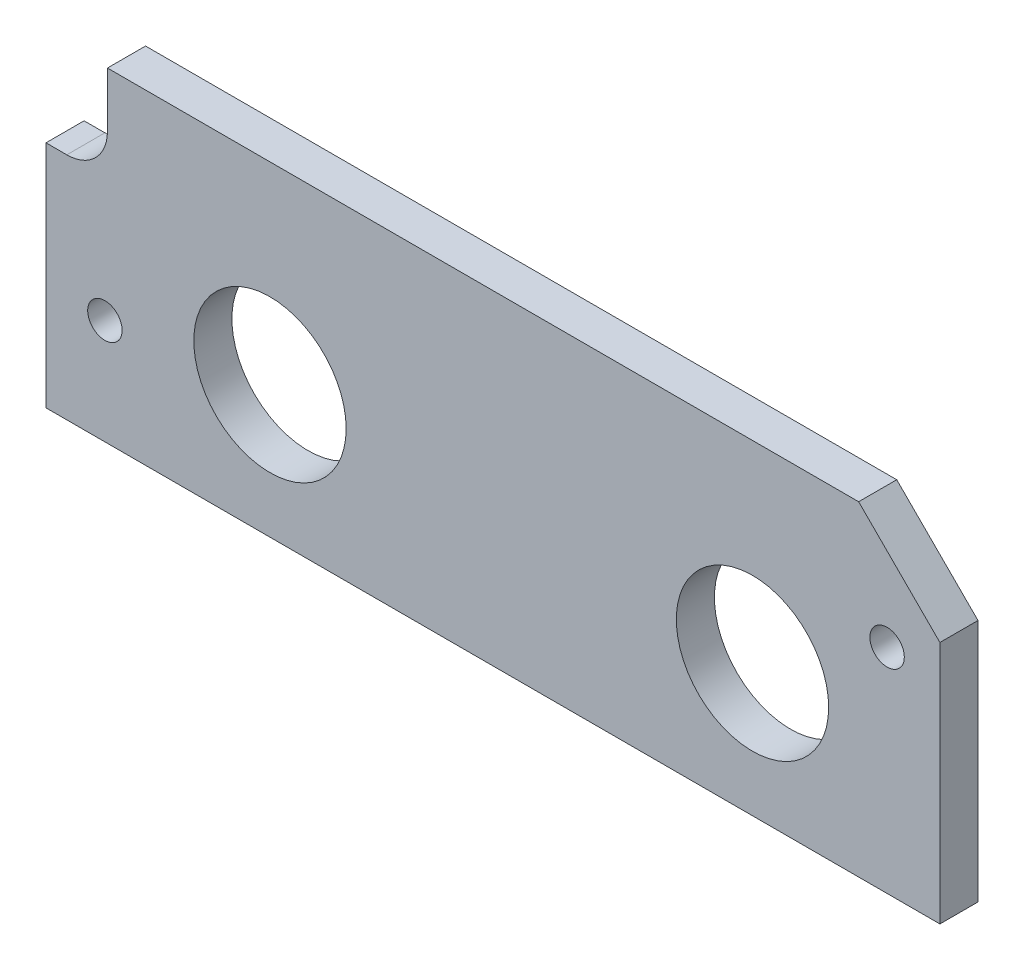
ISO-10303-21;
HEADER;
FILE_DESCRIPTION(('STEP AP214'),'2;1');
FILE_NAME('part.step','',(''),(''),'','','');
FILE_SCHEMA(('AUTOMOTIVE_DESIGN { 1 0 10303 214 1 1 1 1 }'));
ENDSEC;
DATA;
#1=APPLICATION_CONTEXT('core data for automotive mechanical design processes');
#2=APPLICATION_PROTOCOL_DEFINITION('international standard','automotive_design',2000,#1);
#3=PRODUCT_CONTEXT('',#1,'mechanical');
#4=PRODUCT('Part','Part','',(#3));
#5=PRODUCT_RELATED_PRODUCT_CATEGORY('part','',(#4));
#6=PRODUCT_DEFINITION_FORMATION('','',#4);
#7=PRODUCT_DEFINITION_CONTEXT('part definition',#1,'design');
#8=PRODUCT_DEFINITION('design','',#6,#7);
#9=PRODUCT_DEFINITION_SHAPE('','',#8);
#10=(LENGTH_UNIT() NAMED_UNIT(*) SI_UNIT(.MILLI.,.METRE.));
#11=(NAMED_UNIT(*) PLANE_ANGLE_UNIT() SI_UNIT($,.RADIAN.));
#12=(NAMED_UNIT(*) SI_UNIT($,.STERADIAN.) SOLID_ANGLE_UNIT());
#13=UNCERTAINTY_MEASURE_WITH_UNIT(LENGTH_MEASURE(1.E-05),#10,'distance_accuracy_value','');
#14=(GEOMETRIC_REPRESENTATION_CONTEXT(3) GLOBAL_UNCERTAINTY_ASSIGNED_CONTEXT((#13)) GLOBAL_UNIT_ASSIGNED_CONTEXT((#10,
#11,#12)) REPRESENTATION_CONTEXT('',''));
#15=CARTESIAN_POINT('',(0.,0.,0.));
#16=DIRECTION('',(0.,0.,1.));
#17=DIRECTION('',(1.,0.,0.));
#18=AXIS2_PLACEMENT_3D('',#15,#16,#17);
#19=CARTESIAN_POINT('',(-39.116,57.658,4.7625));
#20=DIRECTION('',(0.,-1.,0.));
#21=DIRECTION('',(0.,0.,-1.));
#22=AXIS2_PLACEMENT_3D('',#19,#20,#21);
#23=PLANE('',#22);
#24=DIRECTION('',(-1.,0.,0.));
#25=VECTOR('',#24,1.);
#26=CARTESIAN_POINT('',(-39.116,57.658,0.));
#27=LINE('',#26,#25);
#28=CARTESIAN_POINT('',(-39.116,57.658,0.));
#29=VERTEX_POINT('',#28);
#30=CARTESIAN_POINT('',(-133.0325,57.658,0.));
#31=VERTEX_POINT('',#30);
#32=EDGE_CURVE('E128',#29,#31,#27,.T.);
#33=ORIENTED_EDGE('',*,*,#32,.T.);
#34=DIRECTION('',(0.,0.,-1.));
#35=VECTOR('',#34,1.);
#36=CARTESIAN_POINT('',(-133.0325,57.658,4.7625));
#37=LINE('',#36,#35);
#38=CARTESIAN_POINT('',(-133.0325,57.658,4.7625));
#39=VERTEX_POINT('',#38);
#40=EDGE_CURVE('E11',#39,#31,#37,.T.);
#41=ORIENTED_EDGE('',*,*,#40,.F.);
#42=DIRECTION('',(-1.,0.,0.));
#43=VECTOR('',#42,1.);
#44=CARTESIAN_POINT('',(-39.116,57.658,4.7625));
#45=LINE('',#44,#43);
#46=CARTESIAN_POINT('',(-39.116,57.658,4.7625));
#47=VERTEX_POINT('',#46);
#48=EDGE_CURVE('E143',#47,#39,#45,.T.);
#49=ORIENTED_EDGE('',*,*,#48,.F.);
#50=DIRECTION('',(0.,0.,-1.));
#51=VECTOR('',#50,1.);
#52=CARTESIAN_POINT('',(-39.116,57.658,4.7625));
#53=LINE('',#52,#51);
#54=EDGE_CURVE('E124',#47,#29,#53,.T.);
#55=ORIENTED_EDGE('',*,*,#54,.T.);
#56=EDGE_LOOP('',(#33,#41,#49,#55));
#57=FACE_BOUND('',#56,.T.);
#58=ADVANCED_FACE('F32',(#57),#23,.F.);
#59=CARTESIAN_POINT('',(-133.0325,57.658,4.7625));
#60=DIRECTION('',(1.,0.,0.));
#61=DIRECTION('',(0.,0.,-1.));
#62=AXIS2_PLACEMENT_3D('',#59,#60,#61);
#63=PLANE('',#62);
#64=DIRECTION('',(0.,-1.,0.));
#65=VECTOR('',#64,1.);
#66=CARTESIAN_POINT('',(-133.0325,57.658,0.));
#67=LINE('',#66,#65);
#68=CARTESIAN_POINT('',(-133.0325,50.8,0.));
#69=VERTEX_POINT('',#68);
#70=EDGE_CURVE('E131',#31,#69,#67,.T.);
#71=ORIENTED_EDGE('',*,*,#70,.T.);
#72=DIRECTION('',(0.,0.,-1.));
#73=VECTOR('',#72,1.);
#74=CARTESIAN_POINT('',(-133.0325,50.8,4.7625));
#75=LINE('',#74,#73);
#76=CARTESIAN_POINT('',(-133.0325,50.8,4.7625));
#77=VERTEX_POINT('',#76);
#78=EDGE_CURVE('E40',#77,#69,#75,.T.);
#79=ORIENTED_EDGE('',*,*,#78,.F.);
#80=DIRECTION('',(0.,-1.,0.));
#81=VECTOR('',#80,1.);
#82=CARTESIAN_POINT('',(-133.0325,57.658,4.7625));
#83=LINE('',#82,#81);
#84=EDGE_CURVE('E91',#39,#77,#83,.T.);
#85=ORIENTED_EDGE('',*,*,#84,.F.);
#86=ORIENTED_EDGE('',*,*,#40,.T.);
#87=EDGE_LOOP('',(#71,#79,#85,#86));
#88=FACE_BOUND('',#87,.T.);
#89=ADVANCED_FACE('F228',(#88),#63,.F.);
#90=CARTESIAN_POINT('',(-138.1125,50.8,4.7625));
#91=DIRECTION('',(0.,0.,-1.));
#92=DIRECTION('',(-1.,0.,0.));
#93=AXIS2_PLACEMENT_3D('',#90,#91,#92);
#94=CYLINDRICAL_SURFACE('',#93,5.08);
#95=CARTESIAN_POINT('',(-138.1125,50.8,0.));
#96=DIRECTION('',(0.,0.,-1.));
#97=DIRECTION('',(1.,0.,0.));
#98=AXIS2_PLACEMENT_3D('',#95,#96,#97);
#99=CIRCLE('',#98,5.08);
#100=CARTESIAN_POINT('',(-138.1125,45.72,0.));
#101=VERTEX_POINT('',#100);
#102=EDGE_CURVE('E134',#69,#101,#99,.T.);
#103=ORIENTED_EDGE('',*,*,#102,.T.);
#104=DIRECTION('',(0.,0.,-1.));
#105=VECTOR('',#104,1.);
#106=CARTESIAN_POINT('',(-138.1125,45.72,4.7625));
#107=LINE('',#106,#105);
#108=CARTESIAN_POINT('',(-138.1125,45.72,4.7625));
#109=VERTEX_POINT('',#108);
#110=EDGE_CURVE('E150',#109,#101,#107,.T.);
#111=ORIENTED_EDGE('',*,*,#110,.F.);
#112=CARTESIAN_POINT('',(-138.1125,50.8,4.7625));
#113=DIRECTION('',(0.,0.,-1.));
#114=DIRECTION('',(1.,0.,0.));
#115=AXIS2_PLACEMENT_3D('',#112,#113,#114);
#116=CIRCLE('',#115,5.08);
#117=EDGE_CURVE('E158',#77,#109,#116,.T.);
#118=ORIENTED_EDGE('',*,*,#117,.F.);
#119=ORIENTED_EDGE('',*,*,#78,.T.);
#120=EDGE_LOOP('',(#103,#111,#118,#119));
#121=FACE_BOUND('',#120,.T.);
#122=ADVANCED_FACE('F156',(#121),#94,.F.);
#123=CARTESIAN_POINT('',(-138.1125,45.72,4.7625));
#124=DIRECTION('',(0.,-1.,0.));
#125=DIRECTION('',(1.,0.,0.));
#126=AXIS2_PLACEMENT_3D('',#123,#124,#125);
#127=PLANE('',#126);
#128=DIRECTION('',(-1.,0.,0.));
#129=VECTOR('',#128,1.);
#130=CARTESIAN_POINT('',(-138.1125,45.72,0.));
#131=LINE('',#130,#129);
#132=CARTESIAN_POINT('',(-140.716,45.72,0.));
#133=VERTEX_POINT('',#132);
#134=EDGE_CURVE('E136',#101,#133,#131,.T.);
#135=ORIENTED_EDGE('',*,*,#134,.T.);
#136=DIRECTION('',(0.,0.,-1.));
#137=VECTOR('',#136,1.);
#138=CARTESIAN_POINT('',(-140.716,45.72,4.7625));
#139=LINE('',#138,#137);
#140=CARTESIAN_POINT('',(-140.716,45.72,4.7625));
#141=VERTEX_POINT('',#140);
#142=EDGE_CURVE('E147',#141,#133,#139,.T.);
#143=ORIENTED_EDGE('',*,*,#142,.F.);
#144=DIRECTION('',(-1.,0.,0.));
#145=VECTOR('',#144,1.);
#146=CARTESIAN_POINT('',(-138.1125,45.72,4.7625));
#147=LINE('',#146,#145);
#148=EDGE_CURVE('E170',#109,#141,#147,.T.);
#149=ORIENTED_EDGE('',*,*,#148,.F.);
#150=ORIENTED_EDGE('',*,*,#110,.T.);
#151=EDGE_LOOP('',(#135,#143,#149,#150));
#152=FACE_BOUND('',#151,.T.);
#153=ADVANCED_FACE('F166',(#152),#127,.F.);
#154=CARTESIAN_POINT('',(-140.716,45.72,4.7625));
#155=DIRECTION('',(1.,0.,0.));
#156=DIRECTION('',(0.,0.,-1.));
#157=AXIS2_PLACEMENT_3D('',#154,#155,#156);
#158=PLANE('',#157);
#159=DIRECTION('',(0.,-1.,0.));
#160=VECTOR('',#159,1.);
#161=CARTESIAN_POINT('',(-140.716,45.72,0.));
#162=LINE('',#161,#160);
#163=CARTESIAN_POINT('',(-140.716,17.0180000000001,0.));
#164=VERTEX_POINT('',#163);
#165=EDGE_CURVE('E138',#133,#164,#162,.T.);
#166=ORIENTED_EDGE('',*,*,#165,.T.);
#167=DIRECTION('',(0.,0.,-1.));
#168=VECTOR('',#167,1.);
#169=CARTESIAN_POINT('',(-140.716,17.0180000000001,4.7625));
#170=LINE('',#169,#168);
#171=CARTESIAN_POINT('',(-140.716,17.0180000000001,4.7625));
#172=VERTEX_POINT('',#171);
#173=EDGE_CURVE('E119',#172,#164,#170,.T.);
#174=ORIENTED_EDGE('',*,*,#173,.F.);
#175=DIRECTION('',(0.,-1.,0.));
#176=VECTOR('',#175,1.);
#177=CARTESIAN_POINT('',(-140.716,45.72,4.7625));
#178=LINE('',#177,#176);
#179=EDGE_CURVE('E110',#141,#172,#178,.T.);
#180=ORIENTED_EDGE('',*,*,#179,.F.);
#181=ORIENTED_EDGE('',*,*,#142,.T.);
#182=EDGE_LOOP('',(#166,#174,#180,#181));
#183=FACE_BOUND('',#182,.T.);
#184=ADVANCED_FACE('F169',(#183),#158,.F.);
#185=CARTESIAN_POINT('',(-140.716,17.0180000000001,4.7625));
#186=DIRECTION('',(0.,1.,0.));
#187=DIRECTION('',(-1.,0.,0.));
#188=AXIS2_PLACEMENT_3D('',#185,#186,#187);
#189=PLANE('',#188);
#190=DIRECTION('',(1.,0.,0.));
#191=VECTOR('',#190,1.);
#192=CARTESIAN_POINT('',(-140.716,17.0180000000001,0.));
#193=LINE('',#192,#191);
#194=CARTESIAN_POINT('',(-28.956,17.018,0.));
#195=VERTEX_POINT('',#194);
#196=EDGE_CURVE('E118',#164,#195,#193,.T.);
#197=ORIENTED_EDGE('',*,*,#196,.T.);
#198=DIRECTION('',(0.,0.,-1.));
#199=VECTOR('',#198,1.);
#200=CARTESIAN_POINT('',(-28.956,17.018,4.7625));
#201=LINE('',#200,#199);
#202=CARTESIAN_POINT('',(-28.956,17.018,4.7625));
#203=VERTEX_POINT('',#202);
#204=EDGE_CURVE('E115',#203,#195,#201,.T.);
#205=ORIENTED_EDGE('',*,*,#204,.F.);
#206=DIRECTION('',(1.,0.,0.));
#207=VECTOR('',#206,1.);
#208=CARTESIAN_POINT('',(-140.716,17.0180000000001,4.7625));
#209=LINE('',#208,#207);
#210=EDGE_CURVE('E104',#172,#203,#209,.T.);
#211=ORIENTED_EDGE('',*,*,#210,.F.);
#212=ORIENTED_EDGE('',*,*,#173,.T.);
#213=EDGE_LOOP('',(#197,#205,#211,#212));
#214=FACE_BOUND('',#213,.T.);
#215=ADVANCED_FACE('F116',(#214),#189,.F.);
#216=CARTESIAN_POINT('',(-28.956,17.018,4.7625));
#217=DIRECTION('',(-1.,0.,0.));
#218=DIRECTION('',(0.,0.,1.));
#219=AXIS2_PLACEMENT_3D('',#216,#217,#218);
#220=PLANE('',#219);
#221=DIRECTION('',(0.,1.,0.));
#222=VECTOR('',#221,1.);
#223=CARTESIAN_POINT('',(-28.956,17.018,0.));
#224=LINE('',#223,#222);
#225=CARTESIAN_POINT('',(-28.956,47.498,0.));
#226=VERTEX_POINT('',#225);
#227=EDGE_CURVE('E77',#195,#226,#224,.T.);
#228=ORIENTED_EDGE('',*,*,#227,.T.);
#229=DIRECTION('',(0.,0.,-1.));
#230=VECTOR('',#229,1.);
#231=CARTESIAN_POINT('',(-28.956,47.498,4.7625));
#232=LINE('',#231,#230);
#233=CARTESIAN_POINT('',(-28.956,47.498,4.7625));
#234=VERTEX_POINT('',#233);
#235=EDGE_CURVE('E120',#234,#226,#232,.T.);
#236=ORIENTED_EDGE('',*,*,#235,.F.);
#237=DIRECTION('',(0.,1.,0.));
#238=VECTOR('',#237,1.);
#239=CARTESIAN_POINT('',(-28.956,17.018,4.7625));
#240=LINE('',#239,#238);
#241=EDGE_CURVE('E108',#203,#234,#240,.T.);
#242=ORIENTED_EDGE('',*,*,#241,.F.);
#243=ORIENTED_EDGE('',*,*,#204,.T.);
#244=EDGE_LOOP('',(#228,#236,#242,#243));
#245=FACE_BOUND('',#244,.T.);
#246=ADVANCED_FACE('F122',(#245),#220,.F.);
#247=CARTESIAN_POINT('',(-28.956,47.498,4.7625));
#248=DIRECTION('',(-0.707106781186548,-0.707106781186548,0.));
#249=DIRECTION('',(0.707106781186548,-0.707106781186548,0.));
#250=AXIS2_PLACEMENT_3D('',#247,#248,#249);
#251=PLANE('',#250);
#252=DIRECTION('',(-0.707106781186548,0.707106781186548,0.));
#253=VECTOR('',#252,1.);
#254=CARTESIAN_POINT('',(-28.956,47.498,0.));
#255=LINE('',#254,#253);
#256=EDGE_CURVE('E83',#226,#29,#255,.T.);
#257=ORIENTED_EDGE('',*,*,#256,.T.);
#258=ORIENTED_EDGE('',*,*,#54,.F.);
#259=DIRECTION('',(-0.707106781186548,0.707106781186548,0.));
#260=VECTOR('',#259,1.);
#261=CARTESIAN_POINT('',(-28.956,47.498,4.7625));
#262=LINE('',#261,#260);
#263=EDGE_CURVE('E48',#234,#47,#262,.T.);
#264=ORIENTED_EDGE('',*,*,#263,.F.);
#265=ORIENTED_EDGE('',*,*,#235,.T.);
#266=EDGE_LOOP('',(#257,#258,#264,#265));
#267=FACE_BOUND('',#266,.T.);
#268=ADVANCED_FACE('F204',(#267),#251,.F.);
#269=CARTESIAN_POINT('',(-138.1125,50.8,4.7625));
#270=DIRECTION('',(0.,0.,1.));
#271=DIRECTION('',(1.,0.,0.));
#272=AXIS2_PLACEMENT_3D('',#269,#270,#271);
#273=PLANE('',#272);
#274=CARTESIAN_POINT('',(-112.7125,33.528,4.7625));
#275=DIRECTION('',(0.,0.,1.));
#276=DIRECTION('',(1.,0.,0.));
#277=AXIS2_PLACEMENT_3D('',#274,#275,#276);
#278=CIRCLE('',#277,9.52499999999999);
#279=CARTESIAN_POINT('',(-103.1875,33.528,4.7625));
#280=VERTEX_POINT('',#279);
#281=EDGE_CURVE('E196',#280,#280,#278,.T.);
#282=ORIENTED_EDGE('',*,*,#281,.F.);
#283=EDGE_LOOP('',(#282));
#284=FACE_BOUND('',#283,.T.);
#285=CARTESIAN_POINT('',(-52.3875,33.528,4.7625));
#286=DIRECTION('',(0.,0.,1.));
#287=DIRECTION('',(1.,0.,0.));
#288=AXIS2_PLACEMENT_3D('',#285,#286,#287);
#289=CIRCLE('',#288,9.525);
#290=CARTESIAN_POINT('',(-42.8625,33.528,4.7625));
#291=VERTEX_POINT('',#290);
#292=EDGE_CURVE('E190',#291,#291,#289,.T.);
#293=ORIENTED_EDGE('',*,*,#292,.F.);
#294=EDGE_LOOP('',(#293));
#295=FACE_BOUND('',#294,.T.);
#296=CARTESIAN_POINT('',(-133.35,30.1625,4.7625));
#297=DIRECTION('',(0.,0.,1.));
#298=DIRECTION('',(1.,0.,0.));
#299=AXIS2_PLACEMENT_3D('',#296,#297,#298);
#300=CIRCLE('',#299,2.15264999999998);
#301=CARTESIAN_POINT('',(-131.19735,30.1625,4.7625));
#302=VERTEX_POINT('',#301);
#303=EDGE_CURVE('E184',#302,#302,#300,.T.);
#304=ORIENTED_EDGE('',*,*,#303,.F.);
#305=EDGE_LOOP('',(#304));
#306=FACE_BOUND('',#305,.T.);
#307=CARTESIAN_POINT('',(-35.56,43.688,4.7625));
#308=DIRECTION('',(0.,0.,1.));
#309=DIRECTION('',(1.,0.,0.));
#310=AXIS2_PLACEMENT_3D('',#307,#308,#309);
#311=CIRCLE('',#310,2.15264999999999);
#312=CARTESIAN_POINT('',(-33.40735,43.688,4.7625));
#313=VERTEX_POINT('',#312);
#314=EDGE_CURVE('E178',#313,#313,#311,.T.);
#315=ORIENTED_EDGE('',*,*,#314,.F.);
#316=EDGE_LOOP('',(#315));
#317=FACE_BOUND('',#316,.T.);
#318=ORIENTED_EDGE('',*,*,#48,.T.);
#319=ORIENTED_EDGE('',*,*,#84,.T.);
#320=ORIENTED_EDGE('',*,*,#117,.T.);
#321=ORIENTED_EDGE('',*,*,#148,.T.);
#322=ORIENTED_EDGE('',*,*,#179,.T.);
#323=ORIENTED_EDGE('',*,*,#210,.T.);
#324=ORIENTED_EDGE('',*,*,#241,.T.);
#325=ORIENTED_EDGE('',*,*,#263,.T.);
#326=EDGE_LOOP('',(#318,#319,#320,#321,#322,#323,#324,#325));
#327=FACE_BOUND('',#326,.T.);
#328=ADVANCED_FACE('F106',(#284,#295,#306,#317,#327),#273,.T.);
#329=CARTESIAN_POINT('',(-138.1125,50.8,0.));
#330=DIRECTION('',(0.,0.,1.));
#331=DIRECTION('',(1.,0.,0.));
#332=AXIS2_PLACEMENT_3D('',#329,#330,#331);
#333=PLANE('',#332);
#334=CARTESIAN_POINT('',(-112.7125,33.528,0.));
#335=DIRECTION('',(0.,0.,1.));
#336=DIRECTION('',(1.,0.,0.));
#337=AXIS2_PLACEMENT_3D('',#334,#335,#336);
#338=CIRCLE('',#337,9.52499999999999);
#339=CARTESIAN_POINT('',(-103.1875,33.528,0.));
#340=VERTEX_POINT('',#339);
#341=EDGE_CURVE('E193',#340,#340,#338,.T.);
#342=ORIENTED_EDGE('',*,*,#341,.T.);
#343=EDGE_LOOP('',(#342));
#344=FACE_BOUND('',#343,.T.);
#345=CARTESIAN_POINT('',(-52.3875,33.528,0.));
#346=DIRECTION('',(0.,0.,1.));
#347=DIRECTION('',(1.,0.,0.));
#348=AXIS2_PLACEMENT_3D('',#345,#346,#347);
#349=CIRCLE('',#348,9.525);
#350=CARTESIAN_POINT('',(-42.8625,33.528,0.));
#351=VERTEX_POINT('',#350);
#352=EDGE_CURVE('E187',#351,#351,#349,.T.);
#353=ORIENTED_EDGE('',*,*,#352,.T.);
#354=EDGE_LOOP('',(#353));
#355=FACE_BOUND('',#354,.T.);
#356=CARTESIAN_POINT('',(-133.35,30.1625,0.));
#357=DIRECTION('',(0.,0.,1.));
#358=DIRECTION('',(1.,0.,0.));
#359=AXIS2_PLACEMENT_3D('',#356,#357,#358);
#360=CIRCLE('',#359,2.15265000000001);
#361=CARTESIAN_POINT('',(-131.19735,30.1625,0.));
#362=VERTEX_POINT('',#361);
#363=EDGE_CURVE('E181',#362,#362,#360,.T.);
#364=ORIENTED_EDGE('',*,*,#363,.T.);
#365=EDGE_LOOP('',(#364));
#366=FACE_BOUND('',#365,.T.);
#367=CARTESIAN_POINT('',(-35.56,43.688,0.));
#368=DIRECTION('',(0.,0.,1.));
#369=DIRECTION('',(1.,0.,0.));
#370=AXIS2_PLACEMENT_3D('',#367,#368,#369);
#371=CIRCLE('',#370,2.15265);
#372=CARTESIAN_POINT('',(-33.40735,43.688,0.));
#373=VERTEX_POINT('',#372);
#374=EDGE_CURVE('E132',#373,#373,#371,.T.);
#375=ORIENTED_EDGE('',*,*,#374,.T.);
#376=EDGE_LOOP('',(#375));
#377=FACE_BOUND('',#376,.T.);
#378=ORIENTED_EDGE('',*,*,#32,.F.);
#379=ORIENTED_EDGE('',*,*,#256,.F.);
#380=ORIENTED_EDGE('',*,*,#227,.F.);
#381=ORIENTED_EDGE('',*,*,#196,.F.);
#382=ORIENTED_EDGE('',*,*,#165,.F.);
#383=ORIENTED_EDGE('',*,*,#134,.F.);
#384=ORIENTED_EDGE('',*,*,#102,.F.);
#385=ORIENTED_EDGE('',*,*,#70,.F.);
#386=EDGE_LOOP('',(#378,#379,#380,#381,#382,#383,#384,#385));
#387=FACE_BOUND('',#386,.T.);
#388=ADVANCED_FACE('F162',(#344,#355,#366,#377,#387),#333,.F.);
#389=CARTESIAN_POINT('',(-35.56,43.688,4.7625));
#390=DIRECTION('',(0.,0.,1.));
#391=DIRECTION('',(1.,0.,0.));
#392=AXIS2_PLACEMENT_3D('',#389,#390,#391);
#393=CYLINDRICAL_SURFACE('',#392,2.15265);
#394=ORIENTED_EDGE('',*,*,#374,.F.);
#395=EDGE_LOOP('',(#394));
#396=FACE_BOUND('',#395,.T.);
#397=ORIENTED_EDGE('',*,*,#314,.T.);
#398=EDGE_LOOP('',(#397));
#399=FACE_BOUND('',#398,.T.);
#400=ADVANCED_FACE('F212',(#396,#399),#393,.F.);
#401=CARTESIAN_POINT('',(-133.35,30.1625,4.7625));
#402=DIRECTION('',(0.,0.,1.));
#403=DIRECTION('',(1.,0.,0.));
#404=AXIS2_PLACEMENT_3D('',#401,#402,#403);
#405=CYLINDRICAL_SURFACE('',#404,2.15264999999999);
#406=ORIENTED_EDGE('',*,*,#363,.F.);
#407=EDGE_LOOP('',(#406));
#408=FACE_BOUND('',#407,.T.);
#409=ORIENTED_EDGE('',*,*,#303,.T.);
#410=EDGE_LOOP('',(#409));
#411=FACE_BOUND('',#410,.T.);
#412=ADVANCED_FACE('F214',(#408,#411),#405,.F.);
#413=CARTESIAN_POINT('',(-52.3875,33.528,4.7625));
#414=DIRECTION('',(0.,0.,1.));
#415=DIRECTION('',(1.,0.,0.));
#416=AXIS2_PLACEMENT_3D('',#413,#414,#415);
#417=CYLINDRICAL_SURFACE('',#416,9.525);
#418=ORIENTED_EDGE('',*,*,#352,.F.);
#419=EDGE_LOOP('',(#418));
#420=FACE_BOUND('',#419,.T.);
#421=ORIENTED_EDGE('',*,*,#292,.T.);
#422=EDGE_LOOP('',(#421));
#423=FACE_BOUND('',#422,.T.);
#424=ADVANCED_FACE('F221',(#420,#423),#417,.F.);
#425=CARTESIAN_POINT('',(-112.7125,33.528,4.7625));
#426=DIRECTION('',(0.,0.,1.));
#427=DIRECTION('',(1.,0.,0.));
#428=AXIS2_PLACEMENT_3D('',#425,#426,#427);
#429=CYLINDRICAL_SURFACE('',#428,9.52499999999999);
#430=ORIENTED_EDGE('',*,*,#341,.F.);
#431=EDGE_LOOP('',(#430));
#432=FACE_BOUND('',#431,.T.);
#433=ORIENTED_EDGE('',*,*,#281,.T.);
#434=EDGE_LOOP('',(#433));
#435=FACE_BOUND('',#434,.T.);
#436=ADVANCED_FACE('F200',(#432,#435),#429,.F.);
#437=CLOSED_SHELL('',(#58,#89,#122,#153,#184,#215,#246,#268,#328,#388,#400,#412,#424,#436));
#438=MANIFOLD_SOLID_BREP('B2',#437);
#439=ADVANCED_BREP_SHAPE_REPRESENTATION('',(#18,#438),#14);
#440=SHAPE_DEFINITION_REPRESENTATION(#9,#439);
ENDSEC;
END-ISO-10303-21;
